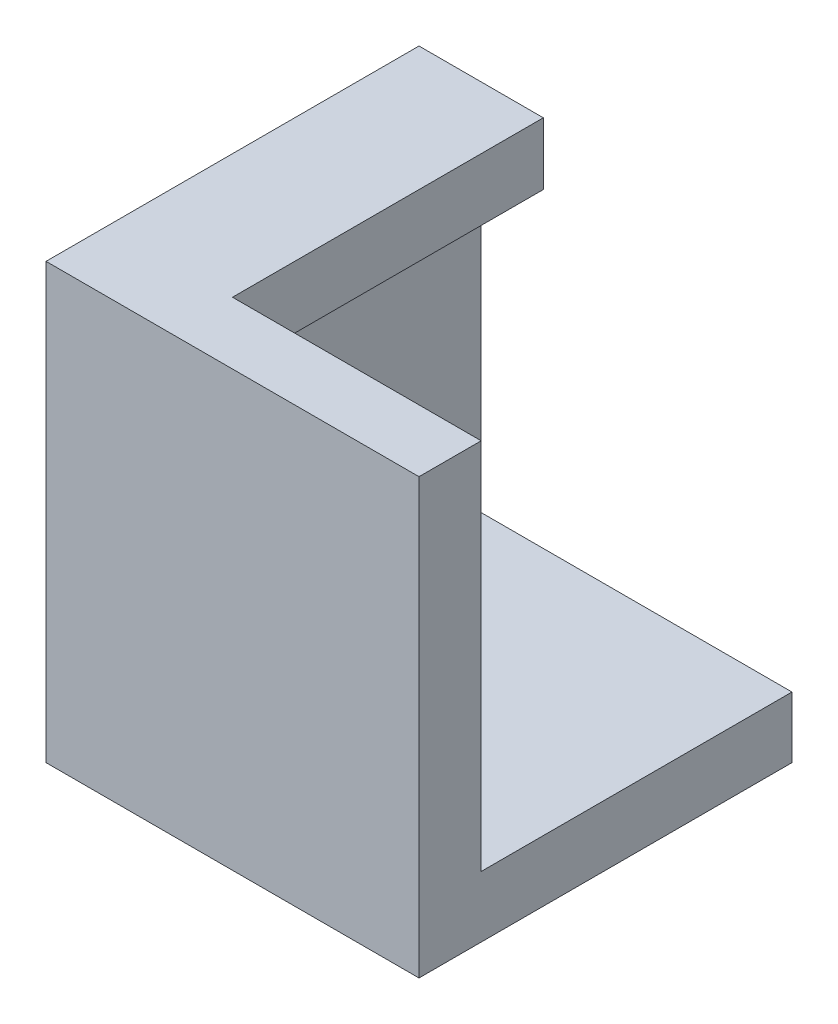
ISO-10303-21;
HEADER;
FILE_DESCRIPTION(('STEP AP214'),'2;1');
FILE_NAME('part.step','',(''),(''),'','','');
FILE_SCHEMA(('AUTOMOTIVE_DESIGN { 1 0 10303 214 1 1 1 1 }'));
ENDSEC;
DATA;
#1=APPLICATION_CONTEXT('core data for automotive mechanical design processes');
#2=APPLICATION_PROTOCOL_DEFINITION('international standard','automotive_design',2000,#1);
#3=PRODUCT_CONTEXT('',#1,'mechanical');
#4=PRODUCT('Part','Part','',(#3));
#5=PRODUCT_RELATED_PRODUCT_CATEGORY('part','',(#4));
#6=PRODUCT_DEFINITION_FORMATION('','',#4);
#7=PRODUCT_DEFINITION_CONTEXT('part definition',#1,'design');
#8=PRODUCT_DEFINITION('design','',#6,#7);
#9=PRODUCT_DEFINITION_SHAPE('','',#8);
#10=(LENGTH_UNIT() NAMED_UNIT(*) SI_UNIT(.MILLI.,.METRE.));
#11=(NAMED_UNIT(*) PLANE_ANGLE_UNIT() SI_UNIT($,.RADIAN.));
#12=(NAMED_UNIT(*) SI_UNIT($,.STERADIAN.) SOLID_ANGLE_UNIT());
#13=UNCERTAINTY_MEASURE_WITH_UNIT(LENGTH_MEASURE(1.E-05),#10,'distance_accuracy_value','');
#14=(GEOMETRIC_REPRESENTATION_CONTEXT(3) GLOBAL_UNCERTAINTY_ASSIGNED_CONTEXT((#13)) GLOBAL_UNIT_ASSIGNED_CONTEXT((#10,
#11,#12)) REPRESENTATION_CONTEXT('',''));
#15=CARTESIAN_POINT('',(0.,0.,0.));
#16=DIRECTION('',(0.,0.,1.));
#17=DIRECTION('',(1.,0.,0.));
#18=AXIS2_PLACEMENT_3D('',#15,#16,#17);
#19=CARTESIAN_POINT('',(10.16,70.96,-10.16));
#20=DIRECTION('',(0.,0.,-1.));
#21=DIRECTION('',(-1.,0.,0.));
#22=AXIS2_PLACEMENT_3D('',#19,#20,#21);
#23=PLANE('',#22);
#24=DIRECTION('',(0.,-1.,0.));
#25=VECTOR('',#24,1.);
#26=CARTESIAN_POINT('',(10.16,70.96,-10.16));
#27=LINE('',#26,#25);
#28=CARTESIAN_POINT('',(10.16,60.8,-10.16));
#29=VERTEX_POINT('',#28);
#30=CARTESIAN_POINT('',(10.16,10.,-10.16));
#31=VERTEX_POINT('',#30);
#32=EDGE_CURVE('E160',#29,#31,#27,.T.);
#33=ORIENTED_EDGE('',*,*,#32,.F.);
#34=DIRECTION('',(-1.,0.,0.));
#35=VECTOR('',#34,1.);
#36=CARTESIAN_POINT('',(20.32,60.8,-10.16));
#37=LINE('',#36,#35);
#38=CARTESIAN_POINT('',(20.32,60.8,-10.16));
#39=VERTEX_POINT('',#38);
#40=EDGE_CURVE('E48',#39,#29,#37,.T.);
#41=ORIENTED_EDGE('',*,*,#40,.F.);
#42=DIRECTION('',(0.,-1.,0.));
#43=VECTOR('',#42,1.);
#44=CARTESIAN_POINT('',(20.32,70.96,-10.16));
#45=LINE('',#44,#43);
#46=CARTESIAN_POINT('',(20.32,70.96,-10.16));
#47=VERTEX_POINT('',#46);
#48=EDGE_CURVE('E124',#47,#39,#45,.T.);
#49=ORIENTED_EDGE('',*,*,#48,.F.);
#50=DIRECTION('',(1.,0.,0.));
#51=VECTOR('',#50,1.);
#52=CARTESIAN_POINT('',(10.16,70.96,-10.16));
#53=LINE('',#52,#51);
#54=CARTESIAN_POINT('',(60.96,70.96,-10.16));
#55=VERTEX_POINT('',#54);
#56=EDGE_CURVE('E115',#47,#55,#53,.T.);
#57=ORIENTED_EDGE('',*,*,#56,.T.);
#58=DIRECTION('',(0.,-1.,0.));
#59=VECTOR('',#58,1.);
#60=CARTESIAN_POINT('',(60.96,70.96,-10.16));
#61=LINE('',#60,#59);
#62=CARTESIAN_POINT('',(60.96,10.,-10.16));
#63=VERTEX_POINT('',#62);
#64=EDGE_CURVE('E157',#55,#63,#61,.T.);
#65=ORIENTED_EDGE('',*,*,#64,.T.);
#66=DIRECTION('',(1.,0.,0.));
#67=VECTOR('',#66,1.);
#68=CARTESIAN_POINT('',(10.16,10.,-10.16));
#69=LINE('',#68,#67);
#70=EDGE_CURVE('E116',#31,#63,#69,.T.);
#71=ORIENTED_EDGE('',*,*,#70,.F.);
#72=EDGE_LOOP('',(#33,#41,#49,#57,#65,#71));
#73=FACE_BOUND('',#72,.T.);
#74=ADVANCED_FACE('F33',(#73),#23,.T.);
#75=CARTESIAN_POINT('',(10.16,70.96,-60.96));
#76=DIRECTION('',(1.,0.,0.));
#77=DIRECTION('',(0.,0.,-1.));
#78=AXIS2_PLACEMENT_3D('',#75,#76,#77);
#79=PLANE('',#78);
#80=DIRECTION('',(0.,-1.,0.));
#81=VECTOR('',#80,1.);
#82=CARTESIAN_POINT('',(10.16,70.96,-60.96));
#83=LINE('',#82,#81);
#84=CARTESIAN_POINT('',(10.16,60.8,-60.96));
#85=VERTEX_POINT('',#84);
#86=CARTESIAN_POINT('',(10.16,10.,-60.96));
#87=VERTEX_POINT('',#86);
#88=EDGE_CURVE('E152',#85,#87,#83,.T.);
#89=ORIENTED_EDGE('',*,*,#88,.F.);
#90=DIRECTION('',(0.,0.,-1.));
#91=VECTOR('',#90,1.);
#92=CARTESIAN_POINT('',(10.16,60.8,-60.96));
#93=LINE('',#92,#91);
#94=EDGE_CURVE('E56',#29,#85,#93,.T.);
#95=ORIENTED_EDGE('',*,*,#94,.F.);
#96=ORIENTED_EDGE('',*,*,#32,.T.);
#97=DIRECTION('',(0.,0.,1.));
#98=VECTOR('',#97,1.);
#99=CARTESIAN_POINT('',(10.16,10.,-60.96));
#100=LINE('',#99,#98);
#101=EDGE_CURVE('E141',#87,#31,#100,.T.);
#102=ORIENTED_EDGE('',*,*,#101,.F.);
#103=EDGE_LOOP('',(#89,#95,#96,#102));
#104=FACE_BOUND('',#103,.T.);
#105=ADVANCED_FACE('F200',(#104),#79,.T.);
#106=CARTESIAN_POINT('',(0.,10.,0.));
#107=DIRECTION('',(1.,0.,0.));
#108=DIRECTION('',(0.,0.,-1.));
#109=AXIS2_PLACEMENT_3D('',#106,#107,#108);
#110=PLANE('',#109);
#111=DIRECTION('',(0.,0.,1.));
#112=VECTOR('',#111,1.);
#113=CARTESIAN_POINT('',(0.,0.,0.));
#114=LINE('',#113,#112);
#115=CARTESIAN_POINT('',(0.,0.,-60.96));
#116=VERTEX_POINT('',#115);
#117=CARTESIAN_POINT('',(0.,0.,0.));
#118=VERTEX_POINT('',#117);
#119=EDGE_CURVE('E159',#116,#118,#114,.T.);
#120=ORIENTED_EDGE('',*,*,#119,.T.);
#121=DIRECTION('',(0.,-1.,0.));
#122=VECTOR('',#121,1.);
#123=CARTESIAN_POINT('',(0.,10.,0.));
#124=LINE('',#123,#122);
#125=CARTESIAN_POINT('',(0.,70.96,0.));
#126=VERTEX_POINT('',#125);
#127=EDGE_CURVE('E11',#126,#118,#124,.T.);
#128=ORIENTED_EDGE('',*,*,#127,.F.);
#129=DIRECTION('',(0.,0.,-1.));
#130=VECTOR('',#129,1.);
#131=CARTESIAN_POINT('',(0.,70.96,0.));
#132=LINE('',#131,#130);
#133=CARTESIAN_POINT('',(0.,70.96,-60.96));
#134=VERTEX_POINT('',#133);
#135=EDGE_CURVE('E150',#126,#134,#132,.T.);
#136=ORIENTED_EDGE('',*,*,#135,.T.);
#137=DIRECTION('',(0.,-1.,0.));
#138=VECTOR('',#137,1.);
#139=CARTESIAN_POINT('',(0.,10.,-60.96));
#140=LINE('',#139,#138);
#141=EDGE_CURVE('E111',#134,#116,#140,.T.);
#142=ORIENTED_EDGE('',*,*,#141,.T.);
#143=EDGE_LOOP('',(#120,#128,#136,#142));
#144=FACE_BOUND('',#143,.T.);
#145=ADVANCED_FACE('F35',(#144),#110,.F.);
#146=CARTESIAN_POINT('',(0.,10.,0.));
#147=DIRECTION('',(0.,0.,-1.));
#148=DIRECTION('',(-1.,0.,0.));
#149=AXIS2_PLACEMENT_3D('',#146,#147,#148);
#150=PLANE('',#149);
#151=DIRECTION('',(1.,0.,0.));
#152=VECTOR('',#151,1.);
#153=CARTESIAN_POINT('',(0.,0.,0.));
#154=LINE('',#153,#152);
#155=CARTESIAN_POINT('',(60.96,0.,0.));
#156=VERTEX_POINT('',#155);
#157=EDGE_CURVE('E171',#118,#156,#154,.T.);
#158=ORIENTED_EDGE('',*,*,#157,.T.);
#159=DIRECTION('',(0.,-1.,0.));
#160=VECTOR('',#159,1.);
#161=CARTESIAN_POINT('',(60.96,10.,0.));
#162=LINE('',#161,#160);
#163=CARTESIAN_POINT('',(60.96,70.96,0.));
#164=VERTEX_POINT('',#163);
#165=EDGE_CURVE('E41',#164,#156,#162,.T.);
#166=ORIENTED_EDGE('',*,*,#165,.F.);
#167=DIRECTION('',(-1.,0.,0.));
#168=VECTOR('',#167,1.);
#169=CARTESIAN_POINT('',(60.96,70.96,0.));
#170=LINE('',#169,#168);
#171=EDGE_CURVE('E147',#164,#126,#170,.T.);
#172=ORIENTED_EDGE('',*,*,#171,.T.);
#173=ORIENTED_EDGE('',*,*,#127,.T.);
#174=EDGE_LOOP('',(#158,#166,#172,#173));
#175=FACE_BOUND('',#174,.T.);
#176=ADVANCED_FACE('F193',(#175),#150,.F.);
#177=CARTESIAN_POINT('',(60.96,10.,0.));
#178=DIRECTION('',(-1.,0.,0.));
#179=DIRECTION('',(0.,0.,1.));
#180=AXIS2_PLACEMENT_3D('',#177,#178,#179);
#181=PLANE('',#180);
#182=DIRECTION('',(0.,0.,-1.));
#183=VECTOR('',#182,1.);
#184=CARTESIAN_POINT('',(60.96,0.,0.));
#185=LINE('',#184,#183);
#186=CARTESIAN_POINT('',(60.96,0.,-60.96));
#187=VERTEX_POINT('',#186);
#188=EDGE_CURVE('E173',#156,#187,#185,.T.);
#189=ORIENTED_EDGE('',*,*,#188,.T.);
#190=DIRECTION('',(0.,-1.,0.));
#191=VECTOR('',#190,1.);
#192=CARTESIAN_POINT('',(60.96,10.,-60.96));
#193=LINE('',#192,#191);
#194=CARTESIAN_POINT('',(60.96,10.,-60.96));
#195=VERTEX_POINT('',#194);
#196=EDGE_CURVE('E177',#195,#187,#193,.T.);
#197=ORIENTED_EDGE('',*,*,#196,.F.);
#198=DIRECTION('',(0.,0.,-1.));
#199=VECTOR('',#198,1.);
#200=CARTESIAN_POINT('',(60.96,10.,0.));
#201=LINE('',#200,#199);
#202=EDGE_CURVE('E163',#63,#195,#201,.T.);
#203=ORIENTED_EDGE('',*,*,#202,.F.);
#204=ORIENTED_EDGE('',*,*,#64,.F.);
#205=DIRECTION('',(0.,0.,1.));
#206=VECTOR('',#205,1.);
#207=CARTESIAN_POINT('',(60.96,70.96,-10.16));
#208=LINE('',#207,#206);
#209=EDGE_CURVE('E144',#55,#164,#208,.T.);
#210=ORIENTED_EDGE('',*,*,#209,.T.);
#211=ORIENTED_EDGE('',*,*,#165,.T.);
#212=EDGE_LOOP('',(#189,#197,#203,#204,#210,#211));
#213=FACE_BOUND('',#212,.T.);
#214=ADVANCED_FACE('F182',(#213),#181,.F.);
#215=CARTESIAN_POINT('',(0.,10.,-60.96));
#216=DIRECTION('',(0.,0.,1.));
#217=DIRECTION('',(1.,0.,0.));
#218=AXIS2_PLACEMENT_3D('',#215,#216,#217);
#219=PLANE('',#218);
#220=DIRECTION('',(-1.,0.,0.));
#221=VECTOR('',#220,1.);
#222=CARTESIAN_POINT('',(0.,0.,-60.96));
#223=LINE('',#222,#221);
#224=EDGE_CURVE('E166',#187,#116,#223,.T.);
#225=ORIENTED_EDGE('',*,*,#224,.T.);
#226=ORIENTED_EDGE('',*,*,#141,.F.);
#227=DIRECTION('',(1.,0.,0.));
#228=VECTOR('',#227,1.);
#229=CARTESIAN_POINT('',(0.,70.96,-60.96));
#230=LINE('',#229,#228);
#231=CARTESIAN_POINT('',(20.32,70.96,-60.96));
#232=VERTEX_POINT('',#231);
#233=EDGE_CURVE('E104',#134,#232,#230,.T.);
#234=ORIENTED_EDGE('',*,*,#233,.T.);
#235=DIRECTION('',(0.,1.,0.));
#236=VECTOR('',#235,1.);
#237=CARTESIAN_POINT('',(20.32,70.96,-60.96));
#238=LINE('',#237,#236);
#239=CARTESIAN_POINT('',(20.32,60.8,-60.96));
#240=VERTEX_POINT('',#239);
#241=EDGE_CURVE('E109',#240,#232,#238,.T.);
#242=ORIENTED_EDGE('',*,*,#241,.F.);
#243=DIRECTION('',(-1.,0.,0.));
#244=VECTOR('',#243,1.);
#245=CARTESIAN_POINT('',(20.32,60.8,-60.96));
#246=LINE('',#245,#244);
#247=EDGE_CURVE('E138',#240,#85,#246,.T.);
#248=ORIENTED_EDGE('',*,*,#247,.T.);
#249=ORIENTED_EDGE('',*,*,#88,.T.);
#250=DIRECTION('',(-1.,0.,0.));
#251=VECTOR('',#250,1.);
#252=CARTESIAN_POINT('',(0.,10.,-60.96));
#253=LINE('',#252,#251);
#254=EDGE_CURVE('E165',#195,#87,#253,.T.);
#255=ORIENTED_EDGE('',*,*,#254,.F.);
#256=ORIENTED_EDGE('',*,*,#196,.T.);
#257=EDGE_LOOP('',(#225,#226,#234,#242,#248,#249,#255,#256));
#258=FACE_BOUND('',#257,.T.);
#259=ADVANCED_FACE('F106',(#258),#219,.F.);
#260=CARTESIAN_POINT('',(0.,10.,0.));
#261=DIRECTION('',(0.,-1.,0.));
#262=DIRECTION('',(0.,0.,-1.));
#263=AXIS2_PLACEMENT_3D('',#260,#261,#262);
#264=PLANE('',#263);
#265=ORIENTED_EDGE('',*,*,#254,.T.);
#266=ORIENTED_EDGE('',*,*,#101,.T.);
#267=ORIENTED_EDGE('',*,*,#70,.T.);
#268=ORIENTED_EDGE('',*,*,#202,.T.);
#269=EDGE_LOOP('',(#265,#266,#267,#268));
#270=FACE_BOUND('',#269,.T.);
#271=ADVANCED_FACE('F210',(#270),#264,.F.);
#272=CARTESIAN_POINT('',(0.,0.,0.));
#273=DIRECTION('',(0.,-1.,0.));
#274=DIRECTION('',(0.,0.,-1.));
#275=AXIS2_PLACEMENT_3D('',#272,#273,#274);
#276=PLANE('',#275);
#277=CARTESIAN_POINT('',(30.48,0.,-30.48));
#278=DIRECTION('',(0.,-1.,0.));
#279=DIRECTION('',(0.,0.,-1.));
#280=AXIS2_PLACEMENT_3D('',#277,#278,#279);
#281=CIRCLE('',#280,6.35);
#282=CARTESIAN_POINT('',(30.48,0.,-36.83));
#283=VERTEX_POINT('',#282);
#284=EDGE_CURVE('E134',#283,#283,#281,.T.);
#285=ORIENTED_EDGE('',*,*,#284,.F.);
#286=EDGE_LOOP('',(#285));
#287=FACE_BOUND('',#286,.T.);
#288=ORIENTED_EDGE('',*,*,#119,.F.);
#289=ORIENTED_EDGE('',*,*,#224,.F.);
#290=ORIENTED_EDGE('',*,*,#188,.F.);
#291=ORIENTED_EDGE('',*,*,#157,.F.);
#292=EDGE_LOOP('',(#288,#289,#290,#291));
#293=FACE_BOUND('',#292,.T.);
#294=ADVANCED_FACE('F190',(#287,#293),#276,.T.);
#295=CARTESIAN_POINT('',(0.,70.96,0.));
#296=DIRECTION('',(0.,-1.,0.));
#297=DIRECTION('',(0.,0.,-1.));
#298=AXIS2_PLACEMENT_3D('',#295,#296,#297);
#299=PLANE('',#298);
#300=ORIENTED_EDGE('',*,*,#56,.F.);
#301=DIRECTION('',(0.,0.,1.));
#302=VECTOR('',#301,1.);
#303=CARTESIAN_POINT('',(20.32,70.96,-60.96));
#304=LINE('',#303,#302);
#305=EDGE_CURVE('E120',#232,#47,#304,.T.);
#306=ORIENTED_EDGE('',*,*,#305,.F.);
#307=ORIENTED_EDGE('',*,*,#233,.F.);
#308=ORIENTED_EDGE('',*,*,#135,.F.);
#309=ORIENTED_EDGE('',*,*,#171,.F.);
#310=ORIENTED_EDGE('',*,*,#209,.F.);
#311=EDGE_LOOP('',(#300,#306,#307,#308,#309,#310));
#312=FACE_BOUND('',#311,.T.);
#313=ADVANCED_FACE('F121',(#312),#299,.F.);
#314=CARTESIAN_POINT('',(20.32,60.8,-60.96));
#315=DIRECTION('',(0.,1.,0.));
#316=DIRECTION('',(0.,0.,1.));
#317=AXIS2_PLACEMENT_3D('',#314,#315,#316);
#318=PLANE('',#317);
#319=ORIENTED_EDGE('',*,*,#94,.T.);
#320=ORIENTED_EDGE('',*,*,#247,.F.);
#321=DIRECTION('',(0.,0.,-1.));
#322=VECTOR('',#321,1.);
#323=CARTESIAN_POINT('',(20.32,60.8,-60.96));
#324=LINE('',#323,#322);
#325=EDGE_CURVE('E128',#39,#240,#324,.T.);
#326=ORIENTED_EDGE('',*,*,#325,.F.);
#327=ORIENTED_EDGE('',*,*,#40,.T.);
#328=EDGE_LOOP('',(#319,#320,#326,#327));
#329=FACE_BOUND('',#328,.T.);
#330=ADVANCED_FACE('F239',(#329),#318,.F.);
#331=CARTESIAN_POINT('',(20.32,0.,0.));
#332=DIRECTION('',(-1.,0.,0.));
#333=DIRECTION('',(0.,0.,1.));
#334=AXIS2_PLACEMENT_3D('',#331,#332,#333);
#335=PLANE('',#334);
#336=ORIENTED_EDGE('',*,*,#241,.T.);
#337=ORIENTED_EDGE('',*,*,#305,.T.);
#338=ORIENTED_EDGE('',*,*,#48,.T.);
#339=ORIENTED_EDGE('',*,*,#325,.T.);
#340=EDGE_LOOP('',(#336,#337,#338,#339));
#341=FACE_BOUND('',#340,.T.);
#342=ADVANCED_FACE('F126',(#341),#335,.F.);
#343=CARTESIAN_POINT('',(30.48,8.89,-30.48));
#344=DIRECTION('',(0.,-1.,0.));
#345=DIRECTION('',(0.,0.,-1.));
#346=AXIS2_PLACEMENT_3D('',#343,#344,#345);
#347=CYLINDRICAL_SURFACE('',#346,6.35);
#348=CARTESIAN_POINT('',(30.48,8.89,-30.48));
#349=DIRECTION('',(0.,-1.,0.));
#350=DIRECTION('',(0.,0.,-1.));
#351=AXIS2_PLACEMENT_3D('',#348,#349,#350);
#352=CIRCLE('',#351,6.35);
#353=CARTESIAN_POINT('',(30.48,8.89,-36.83));
#354=VERTEX_POINT('',#353);
#355=EDGE_CURVE('E131',#354,#354,#352,.T.);
#356=ORIENTED_EDGE('',*,*,#355,.F.);
#357=EDGE_LOOP('',(#356));
#358=FACE_BOUND('',#357,.T.);
#359=ORIENTED_EDGE('',*,*,#284,.T.);
#360=EDGE_LOOP('',(#359));
#361=FACE_BOUND('',#360,.T.);
#362=ADVANCED_FACE('F250',(#358,#361),#347,.F.);
#363=CARTESIAN_POINT('',(30.48,8.89,-30.48));
#364=DIRECTION('',(0.,-1.,0.));
#365=DIRECTION('',(0.,0.,-1.));
#366=AXIS2_PLACEMENT_3D('',#363,#364,#365);
#367=PLANE('',#366);
#368=ORIENTED_EDGE('',*,*,#355,.T.);
#369=EDGE_LOOP('',(#368));
#370=FACE_BOUND('',#369,.T.);
#371=ADVANCED_FACE('F256',(#370),#367,.T.);
#372=CLOSED_SHELL('',(#74,#105,#145,#176,#214,#259,#271,#294,#313,#330,#342,#362,#371));
#373=MANIFOLD_SOLID_BREP('B2',#372);
#374=ADVANCED_BREP_SHAPE_REPRESENTATION('',(#18,#373),#14);
#375=SHAPE_DEFINITION_REPRESENTATION(#9,#374);
ENDSEC;
END-ISO-10303-21;
